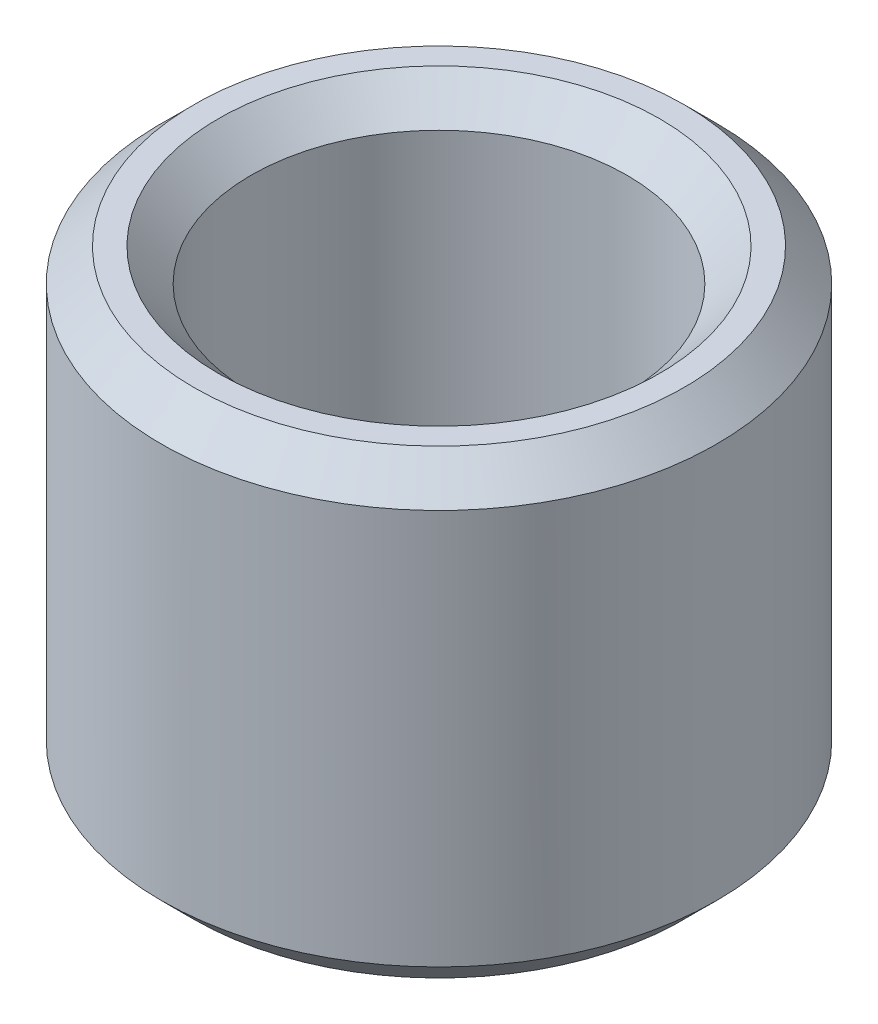
ISO-10303-21;
HEADER;
FILE_DESCRIPTION(('STEP AP214'),'2;1');
FILE_NAME('part.step','',(''),(''),'','','');
FILE_SCHEMA(('AUTOMOTIVE_DESIGN { 1 0 10303 214 1 1 1 1 }'));
ENDSEC;
DATA;
#1=APPLICATION_CONTEXT('core data for automotive mechanical design processes');
#2=APPLICATION_PROTOCOL_DEFINITION('international standard','automotive_design',2000,#1);
#3=PRODUCT_CONTEXT('',#1,'mechanical');
#4=PRODUCT('Part','Part','',(#3));
#5=PRODUCT_RELATED_PRODUCT_CATEGORY('part','',(#4));
#6=PRODUCT_DEFINITION_FORMATION('','',#4);
#7=PRODUCT_DEFINITION_CONTEXT('part definition',#1,'design');
#8=PRODUCT_DEFINITION('design','',#6,#7);
#9=PRODUCT_DEFINITION_SHAPE('','',#8);
#10=(LENGTH_UNIT() NAMED_UNIT(*) SI_UNIT(.MILLI.,.METRE.));
#11=(NAMED_UNIT(*) PLANE_ANGLE_UNIT() SI_UNIT($,.RADIAN.));
#12=(NAMED_UNIT(*) SI_UNIT($,.STERADIAN.) SOLID_ANGLE_UNIT());
#13=UNCERTAINTY_MEASURE_WITH_UNIT(LENGTH_MEASURE(1.E-05),#10,'distance_accuracy_value','');
#14=(GEOMETRIC_REPRESENTATION_CONTEXT(3) GLOBAL_UNCERTAINTY_ASSIGNED_CONTEXT((#13)) GLOBAL_UNIT_ASSIGNED_CONTEXT((#10,
#11,#12)) REPRESENTATION_CONTEXT('',''));
#15=CARTESIAN_POINT('',(0.,0.,0.));
#16=DIRECTION('',(0.,0.,1.));
#17=DIRECTION('',(1.,0.,0.));
#18=AXIS2_PLACEMENT_3D('',#15,#16,#17);
#19=CARTESIAN_POINT('',(0.,12.439810217867,0.));
#20=DIRECTION('',(0.,-1.,0.));
#21=DIRECTION('',(0.,0.,-1.));
#22=AXIS2_PLACEMENT_3D('',#19,#20,#21);
#23=CYLINDRICAL_SURFACE('',#22,7.5);
#24=CARTESIAN_POINT('',(0.,0.881765308253754,0.));
#25=DIRECTION('',(0.,1.,0.));
#26=DIRECTION('',(0.,0.,1.));
#27=AXIS2_PLACEMENT_3D('',#24,#25,#26);
#28=CIRCLE('',#27,7.5);
#29=CARTESIAN_POINT('',(0.,0.881765308253754,-7.5));
#30=VERTEX_POINT('',#29);
#31=EDGE_CURVE('E10',#30,#30,#28,.T.);
#32=CARTESIAN_POINT('',(0.,11.5580449096132,0.));
#33=DIRECTION('',(0.,1.,0.));
#34=DIRECTION('',(0.,0.,1.));
#35=AXIS2_PLACEMENT_3D('',#32,#33,#34);
#36=CIRCLE('',#35,7.5);
#37=CARTESIAN_POINT('',(0.,11.5580449096132,-7.5));
#38=VERTEX_POINT('',#37);
#39=EDGE_CURVE('E50',#38,#38,#36,.F.);
#40=CARTESIAN_POINT('',(0.,0.881765308253754,-7.5));
#41=CARTESIAN_POINT('',(0.,0.992976554101248,-7.5));
#42=CARTESIAN_POINT('',(0.,1.10418779994874,-7.5));
#43=CARTESIAN_POINT('',(0.,1.32661029164373,-7.5));
#44=CARTESIAN_POINT('',(0.,1.43782153749123,-7.5));
#45=CARTESIAN_POINT('',(0.,1.66024402918621,-7.5));
#46=CARTESIAN_POINT('',(0.,1.77145527503371,-7.5));
#47=CARTESIAN_POINT('',(0.,1.9938777667287,-7.5));
#48=CARTESIAN_POINT('',(0.,2.10508901257619,-7.5));
#49=CARTESIAN_POINT('',(0.,2.32751150427118,-7.5));
#50=CARTESIAN_POINT('',(0.,2.43872275011868,-7.5));
#51=CARTESIAN_POINT('',(0.,2.66114524181366,-7.5));
#52=CARTESIAN_POINT('',(0.,2.77235648766116,-7.5));
#53=CARTESIAN_POINT('',(0.,2.99477897935615,-7.5));
#54=CARTESIAN_POINT('',(0.,3.10599022520364,-7.5));
#55=CARTESIAN_POINT('',(0.,3.32841271689863,-7.5));
#56=CARTESIAN_POINT('',(0.,3.43962396274612,-7.5));
#57=CARTESIAN_POINT('',(0.,3.66204645444111,-7.5));
#58=CARTESIAN_POINT('',(0.,3.77325770028861,-7.5));
#59=CARTESIAN_POINT('',(0.,3.9956801919836,-7.5));
#60=CARTESIAN_POINT('',(0.,4.10689143783109,-7.5));
#61=CARTESIAN_POINT('',(0.,4.32931392952608,-7.5));
#62=CARTESIAN_POINT('',(0.,4.44052517537357,-7.5));
#63=CARTESIAN_POINT('',(0.,4.66294766706856,-7.5));
#64=CARTESIAN_POINT('',(0.,4.77415891291606,-7.5));
#65=CARTESIAN_POINT('',(0.,4.99658140461104,-7.5));
#66=CARTESIAN_POINT('',(0.,5.10779265045854,-7.5));
#67=CARTESIAN_POINT('',(0.,5.33021514215353,-7.5));
#68=CARTESIAN_POINT('',(0.,5.44142638800102,-7.5));
#69=CARTESIAN_POINT('',(0.,5.66384887969601,-7.5));
#70=CARTESIAN_POINT('',(0.,5.7750601255435,-7.5));
#71=CARTESIAN_POINT('',(0.,5.99748261723849,-7.5));
#72=CARTESIAN_POINT('',(0.,6.10869386308599,-7.5));
#73=CARTESIAN_POINT('',(0.,6.33111635478098,-7.5));
#74=CARTESIAN_POINT('',(0.,6.44232760062847,-7.5));
#75=CARTESIAN_POINT('',(0.,6.66475009232346,-7.5));
#76=CARTESIAN_POINT('',(0.,6.77596133817095,-7.5));
#77=CARTESIAN_POINT('',(0.,6.99838382986594,-7.5));
#78=CARTESIAN_POINT('',(0.,7.10959507571344,-7.5));
#79=CARTESIAN_POINT('',(0.,7.33201756740843,-7.5));
#80=CARTESIAN_POINT('',(0.,7.44322881325592,-7.5));
#81=CARTESIAN_POINT('',(0.,7.66565130495091,-7.5));
#82=CARTESIAN_POINT('',(0.,7.7768625507984,-7.5));
#83=CARTESIAN_POINT('',(0.,7.99928504249339,-7.5));
#84=CARTESIAN_POINT('',(0.,8.11049628834089,-7.5));
#85=CARTESIAN_POINT('',(0.,8.33291878003587,-7.5));
#86=CARTESIAN_POINT('',(0.,8.44413002588337,-7.5));
#87=CARTESIAN_POINT('',(0.,8.66655251757836,-7.5));
#88=CARTESIAN_POINT('',(0.,8.77776376342585,-7.5));
#89=CARTESIAN_POINT('',(0.,9.00018625512084,-7.5));
#90=CARTESIAN_POINT('',(0.,9.11139750096834,-7.5));
#91=CARTESIAN_POINT('',(0.,9.33381999266332,-7.5));
#92=CARTESIAN_POINT('',(0.,9.44503123851082,-7.5));
#93=CARTESIAN_POINT('',(0.,9.66745373020581,-7.5));
#94=CARTESIAN_POINT('',(0.,9.7786649760533,-7.5));
#95=CARTESIAN_POINT('',(0.,10.0010874677483,-7.5));
#96=CARTESIAN_POINT('',(0.,10.1122987135958,-7.5));
#97=CARTESIAN_POINT('',(0.,10.3347212052908,-7.5));
#98=CARTESIAN_POINT('',(0.,10.4459324511383,-7.5));
#99=CARTESIAN_POINT('',(0.,10.6683549428333,-7.5));
#100=CARTESIAN_POINT('',(0.,10.7795661886808,-7.5));
#101=CARTESIAN_POINT('',(0.,11.0019886803757,-7.5));
#102=CARTESIAN_POINT('',(0.,11.1131999262232,-7.5));
#103=CARTESIAN_POINT('',(0.,11.3356224179182,-7.5));
#104=CARTESIAN_POINT('',(0.,11.4468336637657,-7.5));
#105=CARTESIAN_POINT('',(0.,11.5580449096132,-7.5));
#106=B_SPLINE_CURVE_WITH_KNOTS('',3,(#40,#41,#42,#43,#44,#45,#46,#47,#48,#49,#50,#51,#52,#53,
#54,#55,#56,#57,#58,#59,#60,#61,#62,#63,#64,#65,#66,#67,#68,#69,#70,#71,#72,#73,#74,#75,#76,#77,
#78,#79,#80,#81,#82,#83,#84,#85,#86,#87,#88,#89,#90,#91,#92,#93,#94,#95,#96,#97,#98,#99,#100,
#101,#102,#103,#104,#105),.UNSPECIFIED.,.F.,.F.,(4,2,2,2,2,2,2,2,2,2,2,2,2,2,2,2,2,2,2,2,2,2,2,
2,2,2,2,2,2,2,2,2,4),(0.,0.333633737542484,0.667267475084967,1.00090121262745,1.33453495016993,
1.66816868771242,2.0018024252549,2.33543616279738,2.66906990033986,3.00270363788235,
3.33633737542483,3.66997111296731,4.0036048505098,4.33723858805228,4.67087232559476,
5.00450606313724,5.33813980067973,5.67177353822221,6.00540727576469,6.33904101330718,
6.67267475084966,7.00630848839214,7.33994222593463,7.67357596347711,8.00720970101959,
8.34084343856208,8.67447717610456,9.00811091364704,9.34174465118953,9.67537838873201,
10.0090121262745,10.342645863817,10.6762796013595),.UNSPECIFIED.);
#107=EDGE_CURVE('BSEAM39',#30,#38,#106,.T.);
#108=ORIENTED_EDGE('',*,*,#31,.T.);
#109=ORIENTED_EDGE('',*,*,#39,.T.);
#110=ORIENTED_EDGE('',*,*,#107,.T.);
#111=ORIENTED_EDGE('',*,*,#107,.F.);
#112=EDGE_LOOP('',(#108,#110,#109,#111));
#113=FACE_BOUND('',#112,.T.);
#114=ADVANCED_FACE('F39',(#113),#23,.T.);
#115=CARTESIAN_POINT('',(0.,12.439810217867,0.));
#116=DIRECTION('',(0.,1.,0.));
#117=DIRECTION('',(0.,0.,1.));
#118=AXIS2_PLACEMENT_3D('',#115,#116,#117);
#119=PLANE('',#118);
#120=CARTESIAN_POINT('',(0.,12.439810217867,0.));
#121=DIRECTION('',(0.,1.,0.));
#122=DIRECTION('',(0.,0.,1.));
#123=AXIS2_PLACEMENT_3D('',#120,#121,#122);
#124=CIRCLE('',#123,5.95949578288324);
#125=CARTESIAN_POINT('',(0.,12.439810217867,5.95949578288324));
#126=VERTEX_POINT('',#125);
#127=EDGE_CURVE('E58',#126,#126,#124,.F.);
#128=ORIENTED_EDGE('',*,*,#127,.T.);
#129=EDGE_LOOP('',(#128));
#130=FACE_BOUND('',#129,.T.);
#131=CARTESIAN_POINT('',(0.,12.439810217867,0.));
#132=DIRECTION('',(0.,1.,0.));
#133=DIRECTION('',(0.,0.,1.));
#134=AXIS2_PLACEMENT_3D('',#131,#132,#133);
#135=CIRCLE('',#134,6.61823469174626);
#136=CARTESIAN_POINT('',(0.,12.439810217867,6.61823469174626));
#137=VERTEX_POINT('',#136);
#138=EDGE_CURVE('E61',#137,#137,#135,.T.);
#139=ORIENTED_EDGE('',*,*,#138,.T.);
#140=EDGE_LOOP('',(#139));
#141=FACE_BOUND('',#140,.T.);
#142=ADVANCED_FACE('F88',(#130,#141),#119,.T.);
#143=CARTESIAN_POINT('',(0.,0.,0.));
#144=DIRECTION('',(0.,1.,0.));
#145=DIRECTION('',(0.,0.,1.));
#146=AXIS2_PLACEMENT_3D('',#143,#144,#145);
#147=PLANE('',#146);
#148=CARTESIAN_POINT('',(0.,0.,0.));
#149=DIRECTION('',(0.,1.,0.));
#150=DIRECTION('',(0.,0.,1.));
#151=AXIS2_PLACEMENT_3D('',#148,#149,#150);
#152=CIRCLE('',#151,5.95949578288322);
#153=CARTESIAN_POINT('',(0.,0.,5.95949578288322));
#154=VERTEX_POINT('',#153);
#155=EDGE_CURVE('E51',#154,#154,#152,.T.);
#156=ORIENTED_EDGE('',*,*,#155,.T.);
#157=EDGE_LOOP('',(#156));
#158=FACE_BOUND('',#157,.T.);
#159=CARTESIAN_POINT('',(0.,0.,0.));
#160=DIRECTION('',(0.,1.,0.));
#161=DIRECTION('',(0.,0.,1.));
#162=AXIS2_PLACEMENT_3D('',#159,#160,#161);
#163=CIRCLE('',#162,6.61823469174624);
#164=CARTESIAN_POINT('',(0.,0.,6.61823469174624));
#165=VERTEX_POINT('',#164);
#166=EDGE_CURVE('E54',#165,#165,#163,.F.);
#167=ORIENTED_EDGE('',*,*,#166,.T.);
#168=EDGE_LOOP('',(#167));
#169=FACE_BOUND('',#168,.T.);
#170=ADVANCED_FACE('F83',(#158,#169),#147,.F.);
#171=CARTESIAN_POINT('',(0.,12.439810217867,0.));
#172=DIRECTION('',(0.,-1.,0.));
#173=DIRECTION('',(0.,0.,-1.));
#174=AXIS2_PLACEMENT_3D('',#171,#172,#173);
#175=CYLINDRICAL_SURFACE('',#174,5.07773047462948);
#176=CARTESIAN_POINT('',(0.,11.5580449096132,0.));
#177=DIRECTION('',(0.,1.,0.));
#178=DIRECTION('',(0.,0.,1.));
#179=AXIS2_PLACEMENT_3D('',#176,#177,#178);
#180=CIRCLE('',#179,5.07773047462948);
#181=CARTESIAN_POINT('',(0.,11.5580449096132,-5.07773047462948));
#182=VERTEX_POINT('',#181);
#183=EDGE_CURVE('E67',#182,#182,#180,.T.);
#184=CARTESIAN_POINT('',(0.,0.881765308253738,0.));
#185=DIRECTION('',(0.,1.,0.));
#186=DIRECTION('',(0.,0.,1.));
#187=AXIS2_PLACEMENT_3D('',#184,#185,#186);
#188=CIRCLE('',#187,5.07773047462948);
#189=CARTESIAN_POINT('',(0.,0.881765308253736,-5.07773047462948));
#190=VERTEX_POINT('',#189);
#191=EDGE_CURVE('E69',#190,#190,#188,.F.);
#192=CARTESIAN_POINT('',(0.,11.5580449096132,-5.07773047462948));
#193=CARTESIAN_POINT('',(0.,11.4468336637657,-5.07773047462948));
#194=CARTESIAN_POINT('',(0.,11.3356224179182,-5.07773047462948));
#195=CARTESIAN_POINT('',(0.,11.1131999262232,-5.07773047462948));
#196=CARTESIAN_POINT('',(0.,11.0019886803757,-5.07773047462948));
#197=CARTESIAN_POINT('',(0.,10.7795661886807,-5.07773047462948));
#198=CARTESIAN_POINT('',(0.,10.6683549428332,-5.07773047462948));
#199=CARTESIAN_POINT('',(0.,10.4459324511383,-5.07773047462948));
#200=CARTESIAN_POINT('',(0.,10.3347212052908,-5.07773047462948));
#201=CARTESIAN_POINT('',(0.,10.1122987135958,-5.07773047462948));
#202=CARTESIAN_POINT('',(0.,10.0010874677483,-5.07773047462948));
#203=CARTESIAN_POINT('',(0.,9.77866497605329,-5.07773047462948));
#204=CARTESIAN_POINT('',(0.,9.6674537302058,-5.07773047462948));
#205=CARTESIAN_POINT('',(0.,9.44503123851081,-5.07773047462948));
#206=CARTESIAN_POINT('',(0.,9.33381999266332,-5.07773047462948));
#207=CARTESIAN_POINT('',(0.,9.11139750096832,-5.07773047462948));
#208=CARTESIAN_POINT('',(0.,9.00018625512083,-5.07773047462948));
#209=CARTESIAN_POINT('',(0.,8.77776376342584,-5.07773047462948));
#210=CARTESIAN_POINT('',(0.,8.66655251757835,-5.07773047462948));
#211=CARTESIAN_POINT('',(0.,8.44413002588336,-5.07773047462948));
#212=CARTESIAN_POINT('',(0.,8.33291878003586,-5.07773047462948));
#213=CARTESIAN_POINT('',(0.,8.11049628834088,-5.07773047462948));
#214=CARTESIAN_POINT('',(0.,7.99928504249338,-5.07773047462948));
#215=CARTESIAN_POINT('',(0.,7.77686255079839,-5.07773047462948));
#216=CARTESIAN_POINT('',(0.,7.6656513049509,-5.07773047462948));
#217=CARTESIAN_POINT('',(0.,7.44322881325591,-5.07773047462948));
#218=CARTESIAN_POINT('',(0.,7.33201756740841,-5.07773047462948));
#219=CARTESIAN_POINT('',(0.,7.10959507571343,-5.07773047462948));
#220=CARTESIAN_POINT('',(0.,6.99838382986593,-5.07773047462948));
#221=CARTESIAN_POINT('',(0.,6.77596133817094,-5.07773047462948));
#222=CARTESIAN_POINT('',(0.,6.66475009232345,-5.07773047462948));
#223=CARTESIAN_POINT('',(0.,6.44232760062846,-5.07773047462948));
#224=CARTESIAN_POINT('',(0.,6.33111635478096,-5.07773047462948));
#225=CARTESIAN_POINT('',(0.,6.10869386308598,-5.07773047462948));
#226=CARTESIAN_POINT('',(0.,5.99748261723848,-5.07773047462948));
#227=CARTESIAN_POINT('',(0.,5.77506012554349,-5.07773047462948));
#228=CARTESIAN_POINT('',(0.,5.663848879696,-5.07773047462948));
#229=CARTESIAN_POINT('',(0.,5.44142638800101,-5.07773047462948));
#230=CARTESIAN_POINT('',(0.,5.33021514215351,-5.07773047462948));
#231=CARTESIAN_POINT('',(0.,5.10779265045853,-5.07773047462948));
#232=CARTESIAN_POINT('',(0.,4.99658140461103,-5.07773047462948));
#233=CARTESIAN_POINT('',(0.,4.77415891291604,-5.07773047462948));
#234=CARTESIAN_POINT('',(0.,4.66294766706855,-5.07773047462948));
#235=CARTESIAN_POINT('',(0.,4.44052517537356,-5.07773047462948));
#236=CARTESIAN_POINT('',(0.,4.32931392952606,-5.07773047462948));
#237=CARTESIAN_POINT('',(0.,4.10689143783108,-5.07773047462948));
#238=CARTESIAN_POINT('',(0.,3.99568019198358,-5.07773047462948));
#239=CARTESIAN_POINT('',(0.,3.77325770028859,-5.07773047462948));
#240=CARTESIAN_POINT('',(0.,3.6620464544411,-5.07773047462948));
#241=CARTESIAN_POINT('',(0.,3.43962396274611,-5.07773047462948));
#242=CARTESIAN_POINT('',(0.,3.32841271689861,-5.07773047462948));
#243=CARTESIAN_POINT('',(0.,3.10599022520362,-5.07773047462948));
#244=CARTESIAN_POINT('',(0.,2.99477897935613,-5.07773047462948));
#245=CARTESIAN_POINT('',(0.,2.77235648766114,-5.07773047462948));
#246=CARTESIAN_POINT('',(0.,2.66114524181365,-5.07773047462948));
#247=CARTESIAN_POINT('',(0.,2.43872275011866,-5.07773047462948));
#248=CARTESIAN_POINT('',(0.,2.32751150427117,-5.07773047462948));
#249=CARTESIAN_POINT('',(0.,2.10508901257618,-5.07773047462948));
#250=CARTESIAN_POINT('',(0.,1.99387776672868,-5.07773047462948));
#251=CARTESIAN_POINT('',(0.,1.77145527503369,-5.07773047462948));
#252=CARTESIAN_POINT('',(0.,1.6602440291862,-5.07773047462948));
#253=CARTESIAN_POINT('',(0.,1.43782153749121,-5.07773047462948));
#254=CARTESIAN_POINT('',(0.,1.32661029164371,-5.07773047462948));
#255=CARTESIAN_POINT('',(0.,1.10418779994873,-5.07773047462948));
#256=CARTESIAN_POINT('',(0.,0.992976554101231,-5.07773047462948));
#257=CARTESIAN_POINT('',(0.,0.881765308253736,-5.07773047462948));
#258=B_SPLINE_CURVE_WITH_KNOTS('',3,(#192,#193,#194,#195,#196,#197,#198,#199,#200,#201,#202,
#203,#204,#205,#206,#207,#208,#209,#210,#211,#212,#213,#214,#215,#216,#217,#218,#219,#220,#221,
#222,#223,#224,#225,#226,#227,#228,#229,#230,#231,#232,#233,#234,#235,#236,#237,#238,#239,#240,
#241,#242,#243,#244,#245,#246,#247,#248,#249,#250,#251,#252,#253,#254,#255,#256,#257),
.UNSPECIFIED.,.F.,.F.,(4,2,2,2,2,2,2,2,2,2,2,2,2,2,2,2,2,2,2,2,2,2,2,2,2,2,2,2,2,2,2,2,4),(0.,
0.333633737542482,0.667267475084965,1.00090121262745,1.33453495016993,1.66816868771242,
2.0018024252549,2.33543616279738,2.66906990033987,3.00270363788235,3.33633737542483,
3.66997111296732,4.0036048505098,4.33723858805228,4.67087232559477,5.00450606313725,
5.33813980067973,5.67177353822222,6.0054072757647,6.33904101330718,6.67267475084967,
7.00630848839215,7.33994222593463,7.67357596347712,8.0072097010196,8.34084343856208,
8.67447717610457,9.00811091364705,9.34174465118953,9.67537838873202,10.0090121262745,
10.342645863817,10.6762796013595),.UNSPECIFIED.);
#259=EDGE_CURVE('BSEAM71',#182,#190,#258,.T.);
#260=ORIENTED_EDGE('',*,*,#183,.T.);
#261=ORIENTED_EDGE('',*,*,#191,.T.);
#262=ORIENTED_EDGE('',*,*,#259,.T.);
#263=ORIENTED_EDGE('',*,*,#259,.F.);
#264=EDGE_LOOP('',(#260,#262,#261,#263));
#265=FACE_BOUND('',#264,.T.);
#266=ADVANCED_FACE('F71',(#265),#175,.F.);
#267=CARTESIAN_POINT('',(0.,11.5580449096132,0.));
#268=DIRECTION('',(0.,1.,0.));
#269=DIRECTION('',(0.,0.,1.));
#270=AXIS2_PLACEMENT_3D('',#267,#268,#269);
#271=CONICAL_SURFACE('',#270,5.07773047462948,0.785398163397453);
#272=ORIENTED_EDGE('',*,*,#127,.F.);
#273=EDGE_LOOP('',(#272));
#274=FACE_BOUND('',#273,.T.);
#275=ORIENTED_EDGE('',*,*,#183,.F.);
#276=EDGE_LOOP('',(#275));
#277=FACE_BOUND('',#276,.T.);
#278=ADVANCED_FACE('F77',(#274,#277),#271,.F.);
#279=CARTESIAN_POINT('',(0.,0.,0.));
#280=DIRECTION('',(0.,-1.,0.));
#281=DIRECTION('',(0.,0.,-1.));
#282=AXIS2_PLACEMENT_3D('',#279,#280,#281);
#283=CONICAL_SURFACE('',#282,5.95949578288322,0.785398163397445);
#284=ORIENTED_EDGE('',*,*,#191,.F.);
#285=EDGE_LOOP('',(#284));
#286=FACE_BOUND('',#285,.T.);
#287=ORIENTED_EDGE('',*,*,#155,.F.);
#288=EDGE_LOOP('',(#287));
#289=FACE_BOUND('',#288,.T.);
#290=ADVANCED_FACE('F73',(#286,#289),#283,.F.);
#291=CARTESIAN_POINT('',(0.,0.881765308253754,0.));
#292=DIRECTION('',(0.,1.,0.));
#293=DIRECTION('',(0.,0.,1.));
#294=AXIS2_PLACEMENT_3D('',#291,#292,#293);
#295=CONICAL_SURFACE('',#294,7.5,0.78539816339745);
#296=ORIENTED_EDGE('',*,*,#166,.F.);
#297=EDGE_LOOP('',(#296));
#298=FACE_BOUND('',#297,.T.);
#299=ORIENTED_EDGE('',*,*,#31,.F.);
#300=EDGE_LOOP('',(#299));
#301=FACE_BOUND('',#300,.T.);
#302=ADVANCED_FACE('F76',(#298,#301),#295,.T.);
#303=CARTESIAN_POINT('',(0.,12.439810217867,0.));
#304=DIRECTION('',(0.,-1.,0.));
#305=DIRECTION('',(0.,0.,-1.));
#306=AXIS2_PLACEMENT_3D('',#303,#304,#305);
#307=CONICAL_SURFACE('',#306,6.61823469174626,0.785398163397446);
#308=ORIENTED_EDGE('',*,*,#39,.F.);
#309=EDGE_LOOP('',(#308));
#310=FACE_BOUND('',#309,.T.);
#311=ORIENTED_EDGE('',*,*,#138,.F.);
#312=EDGE_LOOP('',(#311));
#313=FACE_BOUND('',#312,.T.);
#314=ADVANCED_FACE('F45',(#310,#313),#307,.T.);
#315=CLOSED_SHELL('',(#114,#142,#170,#266,#278,#290,#302,#314));
#316=MANIFOLD_SOLID_BREP('B2',#315);
#317=ADVANCED_BREP_SHAPE_REPRESENTATION('',(#18,#316),#14);
#318=SHAPE_DEFINITION_REPRESENTATION(#9,#317);
ENDSEC;
END-ISO-10303-21;
